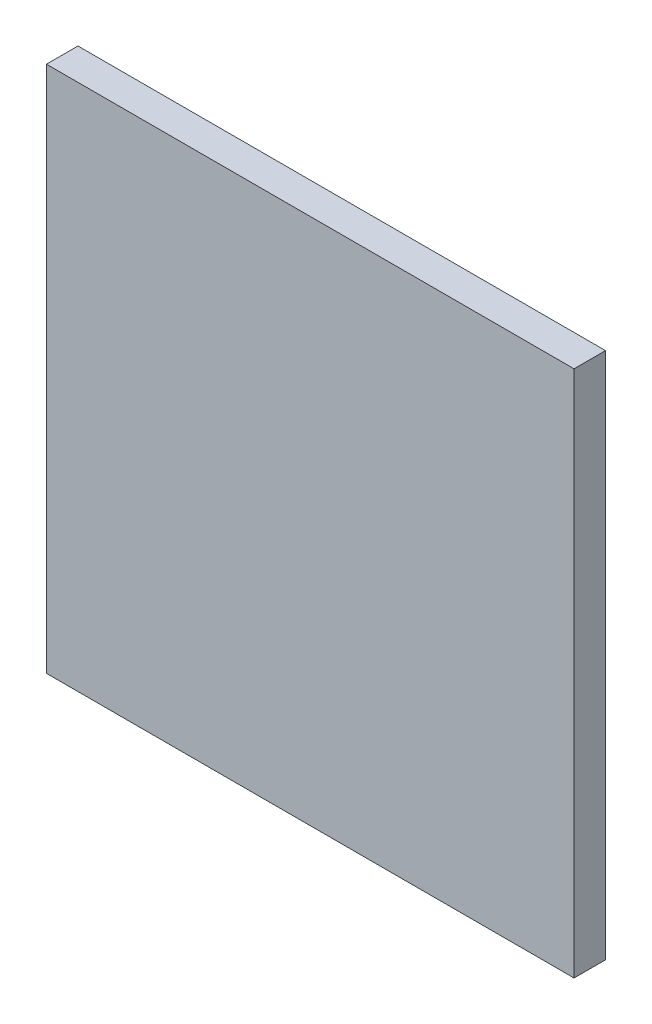
ISO-10303-21;
HEADER;
FILE_DESCRIPTION(('STEP AP214'),'2;1');
FILE_NAME('part.step','',(''),(''),'','','');
FILE_SCHEMA(('AUTOMOTIVE_DESIGN { 1 0 10303 214 1 1 1 1 }'));
ENDSEC;
DATA;
#1=APPLICATION_CONTEXT('core data for automotive mechanical design processes');
#2=APPLICATION_PROTOCOL_DEFINITION('international standard','automotive_design',2000,#1);
#3=PRODUCT_CONTEXT('',#1,'mechanical');
#4=PRODUCT('Part','Part','',(#3));
#5=PRODUCT_RELATED_PRODUCT_CATEGORY('part','',(#4));
#6=PRODUCT_DEFINITION_FORMATION('','',#4);
#7=PRODUCT_DEFINITION_CONTEXT('part definition',#1,'design');
#8=PRODUCT_DEFINITION('design','',#6,#7);
#9=PRODUCT_DEFINITION_SHAPE('','',#8);
#10=(LENGTH_UNIT() NAMED_UNIT(*) SI_UNIT(.MILLI.,.METRE.));
#11=(NAMED_UNIT(*) PLANE_ANGLE_UNIT() SI_UNIT($,.RADIAN.));
#12=(NAMED_UNIT(*) SI_UNIT($,.STERADIAN.) SOLID_ANGLE_UNIT());
#13=UNCERTAINTY_MEASURE_WITH_UNIT(LENGTH_MEASURE(1.E-05),#10,'distance_accuracy_value','');
#14=(GEOMETRIC_REPRESENTATION_CONTEXT(3) GLOBAL_UNCERTAINTY_ASSIGNED_CONTEXT((#13)) GLOBAL_UNIT_ASSIGNED_CONTEXT((#10,
#11,#12)) REPRESENTATION_CONTEXT('',''));
#15=CARTESIAN_POINT('',(0.,0.,0.));
#16=DIRECTION('',(0.,0.,1.));
#17=DIRECTION('',(1.,0.,0.));
#18=AXIS2_PLACEMENT_3D('',#15,#16,#17);
#19=CARTESIAN_POINT('',(-3.35,-3.35,0.));
#20=DIRECTION('',(0.,0.,1.));
#21=DIRECTION('',(1.,0.,0.));
#22=AXIS2_PLACEMENT_3D('',#19,#20,#21);
#23=PLANE('',#22);
#24=DIRECTION('',(0.,-1.,0.));
#25=VECTOR('',#24,1.);
#26=CARTESIAN_POINT('',(3.35,3.35,0.));
#27=LINE('',#26,#25);
#28=CARTESIAN_POINT('',(3.35,3.35,0.));
#29=VERTEX_POINT('',#28);
#30=CARTESIAN_POINT('',(3.35,-3.35,0.));
#31=VERTEX_POINT('',#30);
#32=EDGE_CURVE('E19',#29,#31,#27,.T.);
#33=ORIENTED_EDGE('',*,*,#32,.T.);
#34=DIRECTION('',(1.,0.,0.));
#35=VECTOR('',#34,1.);
#36=CARTESIAN_POINT('',(-3.35,-3.35,0.));
#37=LINE('',#36,#35);
#38=CARTESIAN_POINT('',(-3.35,-3.35,0.));
#39=VERTEX_POINT('',#38);
#40=EDGE_CURVE('E78',#31,#39,#37,.F.);
#41=ORIENTED_EDGE('',*,*,#40,.T.);
#42=DIRECTION('',(0.,1.,0.));
#43=VECTOR('',#42,1.);
#44=CARTESIAN_POINT('',(-3.35,3.35,0.));
#45=LINE('',#44,#43);
#46=CARTESIAN_POINT('',(-3.35,3.35,0.));
#47=VERTEX_POINT('',#46);
#48=EDGE_CURVE('E54',#39,#47,#45,.T.);
#49=ORIENTED_EDGE('',*,*,#48,.T.);
#50=DIRECTION('',(1.,0.,0.));
#51=VECTOR('',#50,1.);
#52=CARTESIAN_POINT('',(-3.35,3.35,0.));
#53=LINE('',#52,#51);
#54=EDGE_CURVE('E56',#47,#29,#53,.T.);
#55=ORIENTED_EDGE('',*,*,#54,.T.);
#56=EDGE_LOOP('',(#33,#41,#49,#55));
#57=FACE_BOUND('',#56,.T.);
#58=ADVANCED_FACE('F16',(#57),#23,.F.);
#59=CARTESIAN_POINT('',(3.35,3.35,0.4));
#60=DIRECTION('',(-1.,0.,0.));
#61=DIRECTION('',(0.,-1.,0.));
#62=AXIS2_PLACEMENT_3D('',#59,#60,#61);
#63=PLANE('',#62);
#64=DIRECTION('',(0.,1.,0.));
#65=VECTOR('',#64,1.);
#66=CARTESIAN_POINT('',(3.35,-3.35,0.4));
#67=LINE('',#66,#65);
#68=CARTESIAN_POINT('',(3.35,-3.35,0.4));
#69=VERTEX_POINT('',#68);
#70=CARTESIAN_POINT('',(3.35,3.35,0.4));
#71=VERTEX_POINT('',#70);
#72=EDGE_CURVE('E82',#69,#71,#67,.T.);
#73=ORIENTED_EDGE('',*,*,#72,.F.);
#74=DIRECTION('',(0.,0.,1.));
#75=VECTOR('',#74,1.);
#76=CARTESIAN_POINT('',(3.35,-3.35,0.4));
#77=LINE('',#76,#75);
#78=EDGE_CURVE('E67',#69,#31,#77,.F.);
#79=ORIENTED_EDGE('',*,*,#78,.T.);
#80=ORIENTED_EDGE('',*,*,#32,.F.);
#81=DIRECTION('',(0.,0.,-1.));
#82=VECTOR('',#81,1.);
#83=CARTESIAN_POINT('',(3.35,3.35,0.4));
#84=LINE('',#83,#82);
#85=EDGE_CURVE('E62',#29,#71,#84,.F.);
#86=ORIENTED_EDGE('',*,*,#85,.T.);
#87=EDGE_LOOP('',(#73,#79,#80,#86));
#88=FACE_BOUND('',#87,.T.);
#89=ADVANCED_FACE('F64',(#88),#63,.F.);
#90=CARTESIAN_POINT('',(-3.35,3.35,0.4));
#91=DIRECTION('',(0.,-1.,0.));
#92=DIRECTION('',(0.,0.,-1.));
#93=AXIS2_PLACEMENT_3D('',#90,#91,#92);
#94=PLANE('',#93);
#95=DIRECTION('',(1.,0.,0.));
#96=VECTOR('',#95,1.);
#97=CARTESIAN_POINT('',(-3.35,3.35,0.4));
#98=LINE('',#97,#96);
#99=CARTESIAN_POINT('',(-3.35,3.35,0.4));
#100=VERTEX_POINT('',#99);
#101=EDGE_CURVE('E71',#71,#100,#98,.F.);
#102=ORIENTED_EDGE('',*,*,#101,.F.);
#103=ORIENTED_EDGE('',*,*,#85,.F.);
#104=ORIENTED_EDGE('',*,*,#54,.F.);
#105=DIRECTION('',(0.,0.,1.));
#106=VECTOR('',#105,1.);
#107=CARTESIAN_POINT('',(-3.35,3.35,0.4));
#108=LINE('',#107,#106);
#109=EDGE_CURVE('E74',#47,#100,#108,.T.);
#110=ORIENTED_EDGE('',*,*,#109,.T.);
#111=EDGE_LOOP('',(#102,#103,#104,#110));
#112=FACE_BOUND('',#111,.T.);
#113=ADVANCED_FACE('F69',(#112),#94,.F.);
#114=CARTESIAN_POINT('',(-3.35,3.35,0.4));
#115=DIRECTION('',(1.,0.,0.));
#116=DIRECTION('',(0.,1.,0.));
#117=AXIS2_PLACEMENT_3D('',#114,#115,#116);
#118=PLANE('',#117);
#119=DIRECTION('',(0.,1.,0.));
#120=VECTOR('',#119,1.);
#121=CARTESIAN_POINT('',(-3.35,-3.35,0.4));
#122=LINE('',#121,#120);
#123=CARTESIAN_POINT('',(-3.35,-3.35,0.4));
#124=VERTEX_POINT('',#123);
#125=EDGE_CURVE('E25',#100,#124,#122,.F.);
#126=ORIENTED_EDGE('',*,*,#125,.F.);
#127=ORIENTED_EDGE('',*,*,#109,.F.);
#128=ORIENTED_EDGE('',*,*,#48,.F.);
#129=DIRECTION('',(0.,0.,1.));
#130=VECTOR('',#129,1.);
#131=CARTESIAN_POINT('',(-3.35,-3.35,0.4));
#132=LINE('',#131,#130);
#133=EDGE_CURVE('E34',#39,#124,#132,.T.);
#134=ORIENTED_EDGE('',*,*,#133,.T.);
#135=EDGE_LOOP('',(#126,#127,#128,#134));
#136=FACE_BOUND('',#135,.T.);
#137=ADVANCED_FACE('F88',(#136),#118,.F.);
#138=CARTESIAN_POINT('',(-3.35,-3.35,0.4));
#139=DIRECTION('',(0.,1.,0.));
#140=DIRECTION('',(0.,0.,1.));
#141=AXIS2_PLACEMENT_3D('',#138,#139,#140);
#142=PLANE('',#141);
#143=DIRECTION('',(1.,0.,0.));
#144=VECTOR('',#143,1.);
#145=CARTESIAN_POINT('',(-3.35,-3.35,0.4));
#146=LINE('',#145,#144);
#147=EDGE_CURVE('E10',#124,#69,#146,.T.);
#148=ORIENTED_EDGE('',*,*,#147,.F.);
#149=ORIENTED_EDGE('',*,*,#133,.F.);
#150=ORIENTED_EDGE('',*,*,#40,.F.);
#151=ORIENTED_EDGE('',*,*,#78,.F.);
#152=EDGE_LOOP('',(#148,#149,#150,#151));
#153=FACE_BOUND('',#152,.T.);
#154=ADVANCED_FACE('F90',(#153),#142,.F.);
#155=CARTESIAN_POINT('',(-3.35,-3.35,0.4));
#156=DIRECTION('',(0.,0.,1.));
#157=DIRECTION('',(1.,0.,0.));
#158=AXIS2_PLACEMENT_3D('',#155,#156,#157);
#159=PLANE('',#158);
#160=ORIENTED_EDGE('',*,*,#125,.T.);
#161=ORIENTED_EDGE('',*,*,#147,.T.);
#162=ORIENTED_EDGE('',*,*,#72,.T.);
#163=ORIENTED_EDGE('',*,*,#101,.T.);
#164=EDGE_LOOP('',(#160,#161,#162,#163));
#165=FACE_BOUND('',#164,.T.);
#166=ADVANCED_FACE('F87',(#165),#159,.T.);
#167=CLOSED_SHELL('',(#58,#89,#113,#137,#154,#166));
#168=MANIFOLD_SOLID_BREP('B1',#167);
#169=ADVANCED_BREP_SHAPE_REPRESENTATION('',(#18,#168),#14);
#170=SHAPE_DEFINITION_REPRESENTATION(#9,#169);
ENDSEC;
END-ISO-10303-21;
